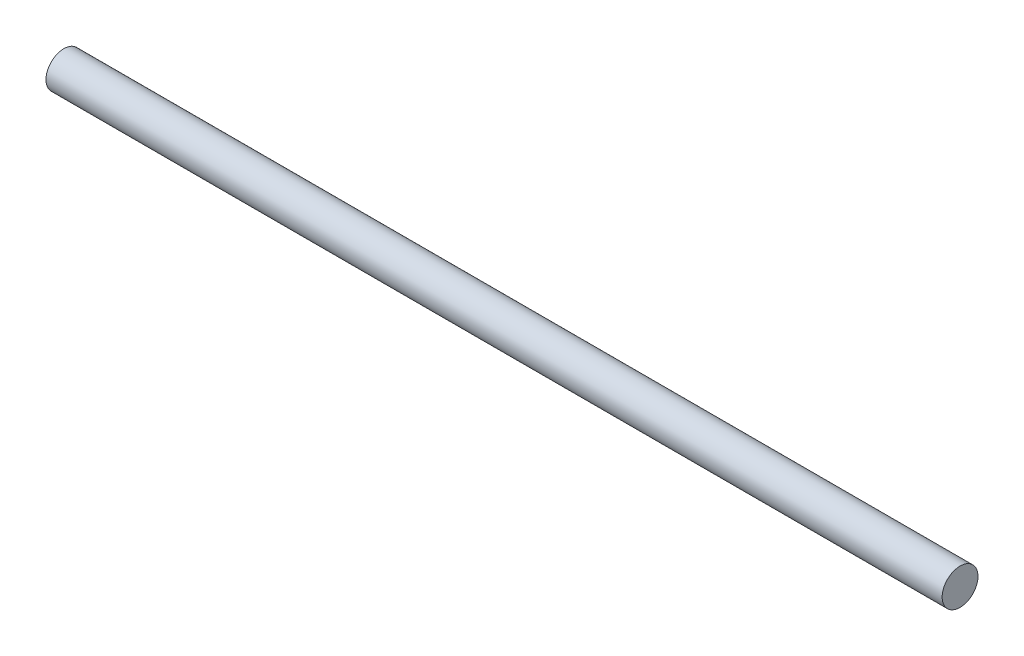
ISO-10303-21;
HEADER;
FILE_DESCRIPTION(('STEP AP214'),'2;1');
FILE_NAME('part.step','',(''),(''),'','','');
FILE_SCHEMA(('AUTOMOTIVE_DESIGN { 1 0 10303 214 1 1 1 1 }'));
ENDSEC;
DATA;
#1=APPLICATION_CONTEXT('core data for automotive mechanical design processes');
#2=APPLICATION_PROTOCOL_DEFINITION('international standard','automotive_design',2000,#1);
#3=PRODUCT_CONTEXT('',#1,'mechanical');
#4=PRODUCT('Part','Part','',(#3));
#5=PRODUCT_RELATED_PRODUCT_CATEGORY('part','',(#4));
#6=PRODUCT_DEFINITION_FORMATION('','',#4);
#7=PRODUCT_DEFINITION_CONTEXT('part definition',#1,'design');
#8=PRODUCT_DEFINITION('design','',#6,#7);
#9=PRODUCT_DEFINITION_SHAPE('','',#8);
#10=(LENGTH_UNIT() NAMED_UNIT(*) SI_UNIT(.MILLI.,.METRE.));
#11=(NAMED_UNIT(*) PLANE_ANGLE_UNIT() SI_UNIT($,.RADIAN.));
#12=(NAMED_UNIT(*) SI_UNIT($,.STERADIAN.) SOLID_ANGLE_UNIT());
#13=UNCERTAINTY_MEASURE_WITH_UNIT(LENGTH_MEASURE(1.E-05),#10,'distance_accuracy_value','');
#14=(GEOMETRIC_REPRESENTATION_CONTEXT(3) GLOBAL_UNCERTAINTY_ASSIGNED_CONTEXT((#13)) GLOBAL_UNIT_ASSIGNED_CONTEXT((#10,
#11,#12)) REPRESENTATION_CONTEXT('',''));
#15=CARTESIAN_POINT('',(0.,0.,0.));
#16=DIRECTION('',(0.,0.,1.));
#17=DIRECTION('',(1.,0.,0.));
#18=AXIS2_PLACEMENT_3D('',#15,#16,#17);
#19=CARTESIAN_POINT('',(39.6875,0.,0.));
#20=DIRECTION('',(-1.,0.,0.));
#21=DIRECTION('',(0.,0.,1.));
#22=AXIS2_PLACEMENT_3D('',#19,#20,#21);
#23=CYLINDRICAL_SURFACE('',#22,1.5875);
#24=CARTESIAN_POINT('',(39.6875,0.,0.));
#25=DIRECTION('',(1.,0.,0.));
#26=DIRECTION('',(0.,0.,-1.));
#27=AXIS2_PLACEMENT_3D('',#24,#25,#26);
#28=CIRCLE('',#27,1.5875);
#29=CARTESIAN_POINT('',(39.6875,0.,-1.5875));
#30=VERTEX_POINT('',#29);
#31=EDGE_CURVE('E10',#30,#30,#28,.T.);
#32=ORIENTED_EDGE('',*,*,#31,.F.);
#33=EDGE_LOOP('',(#32));
#34=FACE_BOUND('',#33,.T.);
#35=CARTESIAN_POINT('',(-39.6875,0.,0.));
#36=DIRECTION('',(1.,0.,0.));
#37=DIRECTION('',(0.,0.,-1.));
#38=AXIS2_PLACEMENT_3D('',#35,#36,#37);
#39=CIRCLE('',#38,1.5875);
#40=CARTESIAN_POINT('',(-39.6875,0.,-1.5875));
#41=VERTEX_POINT('',#40);
#42=EDGE_CURVE('E33',#41,#41,#39,.T.);
#43=ORIENTED_EDGE('',*,*,#42,.T.);
#44=EDGE_LOOP('',(#43));
#45=FACE_BOUND('',#44,.T.);
#46=ADVANCED_FACE('F30',(#34,#45),#23,.T.);
#47=CARTESIAN_POINT('',(39.6875,0.,0.));
#48=DIRECTION('',(1.,0.,0.));
#49=DIRECTION('',(0.,0.,-1.));
#50=AXIS2_PLACEMENT_3D('',#47,#48,#49);
#51=PLANE('',#50);
#52=ORIENTED_EDGE('',*,*,#31,.T.);
#53=EDGE_LOOP('',(#52));
#54=FACE_BOUND('',#53,.T.);
#55=ADVANCED_FACE('F45',(#54),#51,.T.);
#56=CARTESIAN_POINT('',(-39.6875,0.,0.));
#57=DIRECTION('',(1.,0.,0.));
#58=DIRECTION('',(0.,0.,-1.));
#59=AXIS2_PLACEMENT_3D('',#56,#57,#58);
#60=PLANE('',#59);
#61=ORIENTED_EDGE('',*,*,#42,.F.);
#62=EDGE_LOOP('',(#61));
#63=FACE_BOUND('',#62,.T.);
#64=ADVANCED_FACE('F43',(#63),#60,.F.);
#65=CLOSED_SHELL('',(#46,#55,#64));
#66=MANIFOLD_SOLID_BREP('B2',#65);
#67=ADVANCED_BREP_SHAPE_REPRESENTATION('',(#18,#66),#14);
#68=SHAPE_DEFINITION_REPRESENTATION(#9,#67);
ENDSEC;
END-ISO-10303-21;
